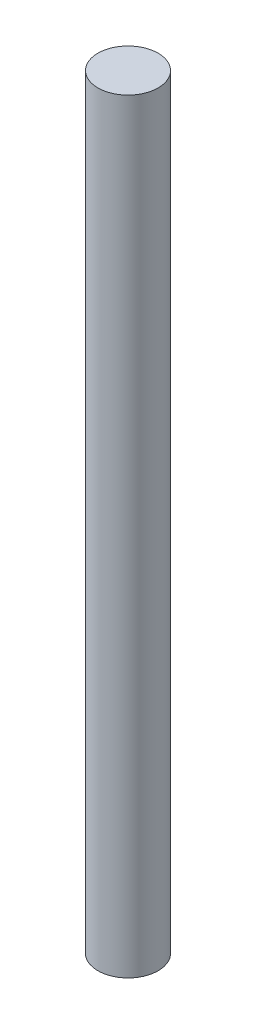
ISO-10303-21;
HEADER;
FILE_DESCRIPTION(('STEP AP214'),'2;1');
FILE_NAME('part.step','',(''),(''),'','','');
FILE_SCHEMA(('AUTOMOTIVE_DESIGN { 1 0 10303 214 1 1 1 1 }'));
ENDSEC;
DATA;
#1=APPLICATION_CONTEXT('core data for automotive mechanical design processes');
#2=APPLICATION_PROTOCOL_DEFINITION('international standard','automotive_design',2000,#1);
#3=PRODUCT_CONTEXT('',#1,'mechanical');
#4=PRODUCT('Part','Part','',(#3));
#5=PRODUCT_RELATED_PRODUCT_CATEGORY('part','',(#4));
#6=PRODUCT_DEFINITION_FORMATION('','',#4);
#7=PRODUCT_DEFINITION_CONTEXT('part definition',#1,'design');
#8=PRODUCT_DEFINITION('design','',#6,#7);
#9=PRODUCT_DEFINITION_SHAPE('','',#8);
#10=(LENGTH_UNIT() NAMED_UNIT(*) SI_UNIT(.MILLI.,.METRE.));
#11=(NAMED_UNIT(*) PLANE_ANGLE_UNIT() SI_UNIT($,.RADIAN.));
#12=(NAMED_UNIT(*) SI_UNIT($,.STERADIAN.) SOLID_ANGLE_UNIT());
#13=UNCERTAINTY_MEASURE_WITH_UNIT(LENGTH_MEASURE(1.E-05),#10,'distance_accuracy_value','');
#14=(GEOMETRIC_REPRESENTATION_CONTEXT(3) GLOBAL_UNCERTAINTY_ASSIGNED_CONTEXT((#13)) GLOBAL_UNIT_ASSIGNED_CONTEXT((#10,
#11,#12)) REPRESENTATION_CONTEXT('',''));
#15=CARTESIAN_POINT('',(0.,0.,0.));
#16=DIRECTION('',(0.,0.,1.));
#17=DIRECTION('',(1.,0.,0.));
#18=AXIS2_PLACEMENT_3D('',#15,#16,#17);
#19=CARTESIAN_POINT('',(0.,304.8,0.));
#20=DIRECTION('',(0.,-1.,0.));
#21=DIRECTION('',(0.,0.,-1.));
#22=AXIS2_PLACEMENT_3D('',#19,#20,#21);
#23=CYLINDRICAL_SURFACE('',#22,6.);
#24=CARTESIAN_POINT('',(0.,304.8,0.));
#25=DIRECTION('',(0.,1.,0.));
#26=DIRECTION('',(0.,0.,1.));
#27=AXIS2_PLACEMENT_3D('',#24,#25,#26);
#28=CIRCLE('',#27,6.);
#29=CARTESIAN_POINT('',(0.,304.8,6.));
#30=VERTEX_POINT('',#29);
#31=EDGE_CURVE('E10',#30,#30,#28,.T.);
#32=ORIENTED_EDGE('',*,*,#31,.F.);
#33=EDGE_LOOP('',(#32));
#34=FACE_BOUND('',#33,.T.);
#35=CARTESIAN_POINT('',(0.,152.4,0.));
#36=DIRECTION('',(0.,-1.,0.));
#37=DIRECTION('',(0.,0.,-1.));
#38=AXIS2_PLACEMENT_3D('',#35,#36,#37);
#39=CIRCLE('',#38,6.);
#40=CARTESIAN_POINT('',(0.,152.4,-6.));
#41=VERTEX_POINT('',#40);
#42=EDGE_CURVE('E34',#41,#41,#39,.T.);
#43=ORIENTED_EDGE('',*,*,#42,.F.);
#44=EDGE_LOOP('',(#43));
#45=FACE_BOUND('',#44,.T.);
#46=ADVANCED_FACE('F31',(#34,#45),#23,.T.);
#47=CARTESIAN_POINT('',(0.,304.8,0.));
#48=DIRECTION('',(0.,1.,0.));
#49=DIRECTION('',(0.,0.,1.));
#50=AXIS2_PLACEMENT_3D('',#47,#48,#49);
#51=PLANE('',#50);
#52=ORIENTED_EDGE('',*,*,#31,.T.);
#53=EDGE_LOOP('',(#52));
#54=FACE_BOUND('',#53,.T.);
#55=ADVANCED_FACE('F46',(#54),#51,.T.);
#56=CARTESIAN_POINT('',(0.,152.4,0.));
#57=DIRECTION('',(0.,-1.,0.));
#58=DIRECTION('',(0.,0.,-1.));
#59=AXIS2_PLACEMENT_3D('',#56,#57,#58);
#60=PLANE('',#59);
#61=ORIENTED_EDGE('',*,*,#42,.T.);
#62=EDGE_LOOP('',(#61));
#63=FACE_BOUND('',#62,.T.);
#64=ADVANCED_FACE('F43',(#63),#60,.T.);
#65=CLOSED_SHELL('',(#46,#55,#64));
#66=MANIFOLD_SOLID_BREP('B2',#65);
#67=ADVANCED_BREP_SHAPE_REPRESENTATION('',(#18,#66),#14);
#68=SHAPE_DEFINITION_REPRESENTATION(#9,#67);
ENDSEC;
END-ISO-10303-21;
